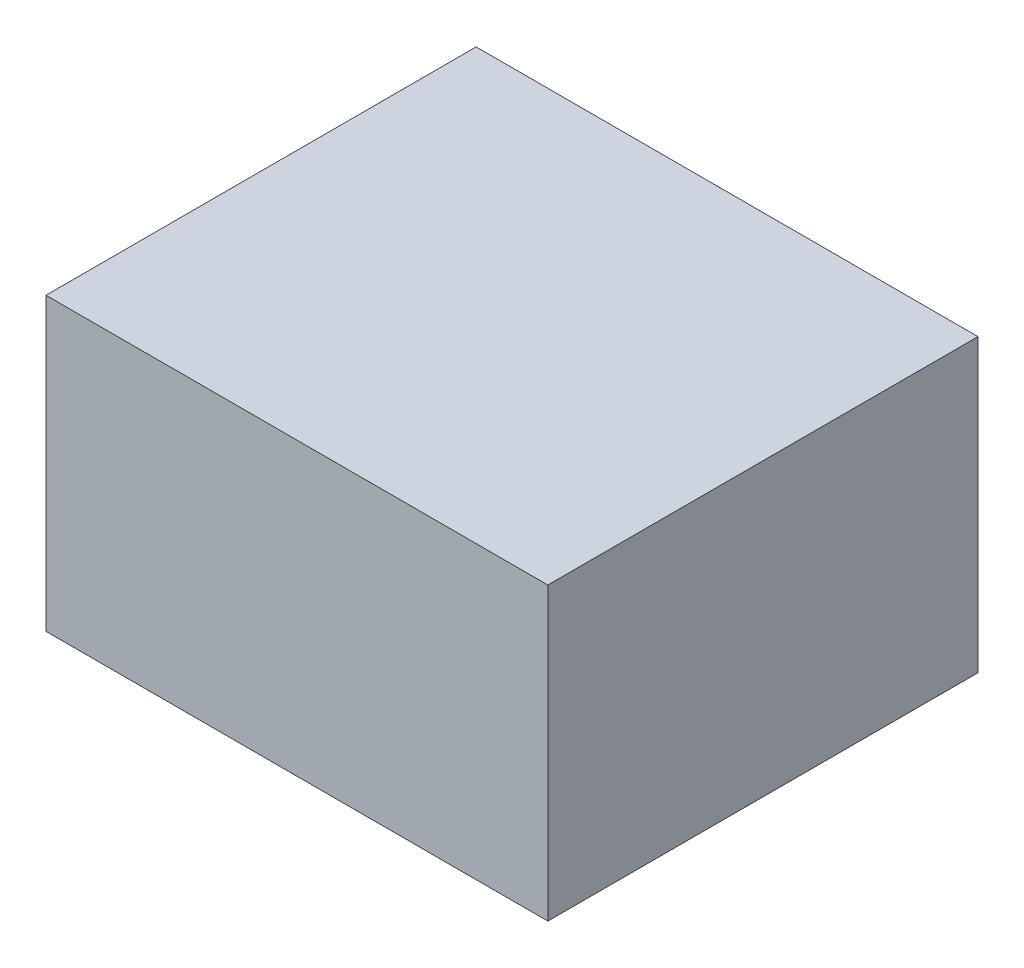
ISO-10303-21;
HEADER;
FILE_DESCRIPTION(('STEP AP214'),'2;1');
FILE_NAME('part.step','',(''),(''),'','','');
FILE_SCHEMA(('AUTOMOTIVE_DESIGN { 1 0 10303 214 1 1 1 1 }'));
ENDSEC;
DATA;
#1=APPLICATION_CONTEXT('core data for automotive mechanical design processes');
#2=APPLICATION_PROTOCOL_DEFINITION('international standard','automotive_design',2000,#1);
#3=PRODUCT_CONTEXT('',#1,'mechanical');
#4=PRODUCT('Part','Part','',(#3));
#5=PRODUCT_RELATED_PRODUCT_CATEGORY('part','',(#4));
#6=PRODUCT_DEFINITION_FORMATION('','',#4);
#7=PRODUCT_DEFINITION_CONTEXT('part definition',#1,'design');
#8=PRODUCT_DEFINITION('design','',#6,#7);
#9=PRODUCT_DEFINITION_SHAPE('','',#8);
#10=(LENGTH_UNIT() NAMED_UNIT(*) SI_UNIT(.MILLI.,.METRE.));
#11=(NAMED_UNIT(*) PLANE_ANGLE_UNIT() SI_UNIT($,.RADIAN.));
#12=(NAMED_UNIT(*) SI_UNIT($,.STERADIAN.) SOLID_ANGLE_UNIT());
#13=UNCERTAINTY_MEASURE_WITH_UNIT(LENGTH_MEASURE(1.E-05),#10,'distance_accuracy_value','');
#14=(GEOMETRIC_REPRESENTATION_CONTEXT(3) GLOBAL_UNCERTAINTY_ASSIGNED_CONTEXT((#13)) GLOBAL_UNIT_ASSIGNED_CONTEXT((#10,
#11,#12)) REPRESENTATION_CONTEXT('',''));
#15=CARTESIAN_POINT('',(0.,0.,0.));
#16=DIRECTION('',(0.,0.,1.));
#17=DIRECTION('',(1.,0.,0.));
#18=AXIS2_PLACEMENT_3D('',#15,#16,#17);
#19=CARTESIAN_POINT('',(0.15,0.475,-1.025));
#20=DIRECTION('',(0.,0.,1.));
#21=DIRECTION('',(1.,0.,0.));
#22=AXIS2_PLACEMENT_3D('',#19,#20,#21);
#23=PLANE('',#22);
#24=DIRECTION('',(-1.,0.,0.));
#25=VECTOR('',#24,1.);
#26=CARTESIAN_POINT('',(0.15,0.272,-1.025));
#27=LINE('',#26,#25);
#28=CARTESIAN_POINT('',(0.15,0.272,-1.025));
#29=VERTEX_POINT('',#28);
#30=CARTESIAN_POINT('',(-0.200000000000001,0.272,-1.025));
#31=VERTEX_POINT('',#30);
#32=EDGE_CURVE('E11',#29,#31,#27,.T.);
#33=ORIENTED_EDGE('',*,*,#32,.T.);
#34=DIRECTION('',(0.,-1.,0.));
#35=VECTOR('',#34,1.);
#36=CARTESIAN_POINT('',(-0.200000000000001,0.475,-1.025));
#37=LINE('',#36,#35);
#38=CARTESIAN_POINT('',(-0.200000000000001,0.475,-1.025));
#39=VERTEX_POINT('',#38);
#40=EDGE_CURVE('E24',#39,#31,#37,.T.);
#41=ORIENTED_EDGE('',*,*,#40,.F.);
#42=DIRECTION('',(-1.,0.,0.));
#43=VECTOR('',#42,1.);
#44=CARTESIAN_POINT('',(0.15,0.475,-1.025));
#45=LINE('',#44,#43);
#46=CARTESIAN_POINT('',(0.15,0.475,-1.025));
#47=VERTEX_POINT('',#46);
#48=EDGE_CURVE('E88',#47,#39,#45,.T.);
#49=ORIENTED_EDGE('',*,*,#48,.F.);
#50=DIRECTION('',(0.,-1.,0.));
#51=VECTOR('',#50,1.);
#52=CARTESIAN_POINT('',(0.15,0.475,-1.025));
#53=LINE('',#52,#51);
#54=EDGE_CURVE('E77',#47,#29,#53,.T.);
#55=ORIENTED_EDGE('',*,*,#54,.T.);
#56=EDGE_LOOP('',(#33,#41,#49,#55));
#57=FACE_BOUND('',#56,.T.);
#58=ADVANCED_FACE('F17',(#57),#23,.F.);
#59=CARTESIAN_POINT('',(-0.200000000000001,0.475,-1.025));
#60=DIRECTION('',(1.,0.,0.));
#61=DIRECTION('',(0.,0.,-1.));
#62=AXIS2_PLACEMENT_3D('',#59,#60,#61);
#63=PLANE('',#62);
#64=DIRECTION('',(0.,0.,1.));
#65=VECTOR('',#64,1.);
#66=CARTESIAN_POINT('',(-0.200000000000001,0.272,-1.025));
#67=LINE('',#66,#65);
#68=CARTESIAN_POINT('',(-0.200000000000001,0.272,-0.725));
#69=VERTEX_POINT('',#68);
#70=EDGE_CURVE('E85',#31,#69,#67,.T.);
#71=ORIENTED_EDGE('',*,*,#70,.T.);
#72=DIRECTION('',(0.,-1.,0.));
#73=VECTOR('',#72,1.);
#74=CARTESIAN_POINT('',(-0.200000000000001,0.475,-0.725));
#75=LINE('',#74,#73);
#76=CARTESIAN_POINT('',(-0.200000000000001,0.475,-0.725));
#77=VERTEX_POINT('',#76);
#78=EDGE_CURVE('E83',#77,#69,#75,.T.);
#79=ORIENTED_EDGE('',*,*,#78,.F.);
#80=DIRECTION('',(0.,0.,1.));
#81=VECTOR('',#80,1.);
#82=CARTESIAN_POINT('',(-0.200000000000001,0.475,-1.025));
#83=LINE('',#82,#81);
#84=EDGE_CURVE('E72',#39,#77,#83,.T.);
#85=ORIENTED_EDGE('',*,*,#84,.F.);
#86=ORIENTED_EDGE('',*,*,#40,.T.);
#87=EDGE_LOOP('',(#71,#79,#85,#86));
#88=FACE_BOUND('',#87,.T.);
#89=ADVANCED_FACE('F90',(#88),#63,.F.);
#90=CARTESIAN_POINT('',(-0.200000000000001,0.475,-0.725));
#91=DIRECTION('',(0.,0.,-1.));
#92=DIRECTION('',(-1.,0.,0.));
#93=AXIS2_PLACEMENT_3D('',#90,#91,#92);
#94=PLANE('',#93);
#95=DIRECTION('',(1.,0.,0.));
#96=VECTOR('',#95,1.);
#97=CARTESIAN_POINT('',(-0.200000000000001,0.272,-0.725));
#98=LINE('',#97,#96);
#99=CARTESIAN_POINT('',(0.15,0.272,-0.725));
#100=VERTEX_POINT('',#99);
#101=EDGE_CURVE('E60',#69,#100,#98,.T.);
#102=ORIENTED_EDGE('',*,*,#101,.T.);
#103=DIRECTION('',(0.,-1.,0.));
#104=VECTOR('',#103,1.);
#105=CARTESIAN_POINT('',(0.15,0.475,-0.725));
#106=LINE('',#105,#104);
#107=CARTESIAN_POINT('',(0.15,0.475,-0.725));
#108=VERTEX_POINT('',#107);
#109=EDGE_CURVE('E54',#108,#100,#106,.T.);
#110=ORIENTED_EDGE('',*,*,#109,.F.);
#111=DIRECTION('',(1.,0.,0.));
#112=VECTOR('',#111,1.);
#113=CARTESIAN_POINT('',(-0.200000000000001,0.475,-0.725));
#114=LINE('',#113,#112);
#115=EDGE_CURVE('E58',#77,#108,#114,.T.);
#116=ORIENTED_EDGE('',*,*,#115,.F.);
#117=ORIENTED_EDGE('',*,*,#78,.T.);
#118=EDGE_LOOP('',(#102,#110,#116,#117));
#119=FACE_BOUND('',#118,.T.);
#120=ADVANCED_FACE('F56',(#119),#94,.F.);
#121=CARTESIAN_POINT('',(0.15,0.475,-0.725));
#122=DIRECTION('',(-1.,0.,0.));
#123=DIRECTION('',(0.,0.,1.));
#124=AXIS2_PLACEMENT_3D('',#121,#122,#123);
#125=PLANE('',#124);
#126=DIRECTION('',(0.,0.,-1.));
#127=VECTOR('',#126,1.);
#128=CARTESIAN_POINT('',(0.15,0.272,-0.725));
#129=LINE('',#128,#127);
#130=EDGE_CURVE('E73',#100,#29,#129,.T.);
#131=ORIENTED_EDGE('',*,*,#130,.T.);
#132=ORIENTED_EDGE('',*,*,#54,.F.);
#133=DIRECTION('',(0.,0.,-1.));
#134=VECTOR('',#133,1.);
#135=CARTESIAN_POINT('',(0.15,0.475,-0.725));
#136=LINE('',#135,#134);
#137=EDGE_CURVE('E70',#108,#47,#136,.T.);
#138=ORIENTED_EDGE('',*,*,#137,.F.);
#139=ORIENTED_EDGE('',*,*,#109,.T.);
#140=EDGE_LOOP('',(#131,#132,#138,#139));
#141=FACE_BOUND('',#140,.T.);
#142=ADVANCED_FACE('F76',(#141),#125,.F.);
#143=CARTESIAN_POINT('',(0.,0.475,0.));
#144=DIRECTION('',(0.,1.,0.));
#145=DIRECTION('',(0.,0.,1.));
#146=AXIS2_PLACEMENT_3D('',#143,#144,#145);
#147=PLANE('',#146);
#148=ORIENTED_EDGE('',*,*,#48,.T.);
#149=ORIENTED_EDGE('',*,*,#84,.T.);
#150=ORIENTED_EDGE('',*,*,#115,.T.);
#151=ORIENTED_EDGE('',*,*,#137,.T.);
#152=EDGE_LOOP('',(#148,#149,#150,#151));
#153=FACE_BOUND('',#152,.T.);
#154=ADVANCED_FACE('F69',(#153),#147,.T.);
#155=CARTESIAN_POINT('',(0.,0.272,0.));
#156=DIRECTION('',(0.,1.,0.));
#157=DIRECTION('',(0.,0.,1.));
#158=AXIS2_PLACEMENT_3D('',#155,#156,#157);
#159=PLANE('',#158);
#160=ORIENTED_EDGE('',*,*,#32,.F.);
#161=ORIENTED_EDGE('',*,*,#130,.F.);
#162=ORIENTED_EDGE('',*,*,#101,.F.);
#163=ORIENTED_EDGE('',*,*,#70,.F.);
#164=EDGE_LOOP('',(#160,#161,#162,#163));
#165=FACE_BOUND('',#164,.T.);
#166=ADVANCED_FACE('F91',(#165),#159,.F.);
#167=CLOSED_SHELL('',(#58,#89,#120,#142,#154,#166));
#168=MANIFOLD_SOLID_BREP('B1',#167);
#169=ADVANCED_BREP_SHAPE_REPRESENTATION('',(#18,#168),#14);
#170=SHAPE_DEFINITION_REPRESENTATION(#9,#169);
ENDSEC;
END-ISO-10303-21;
